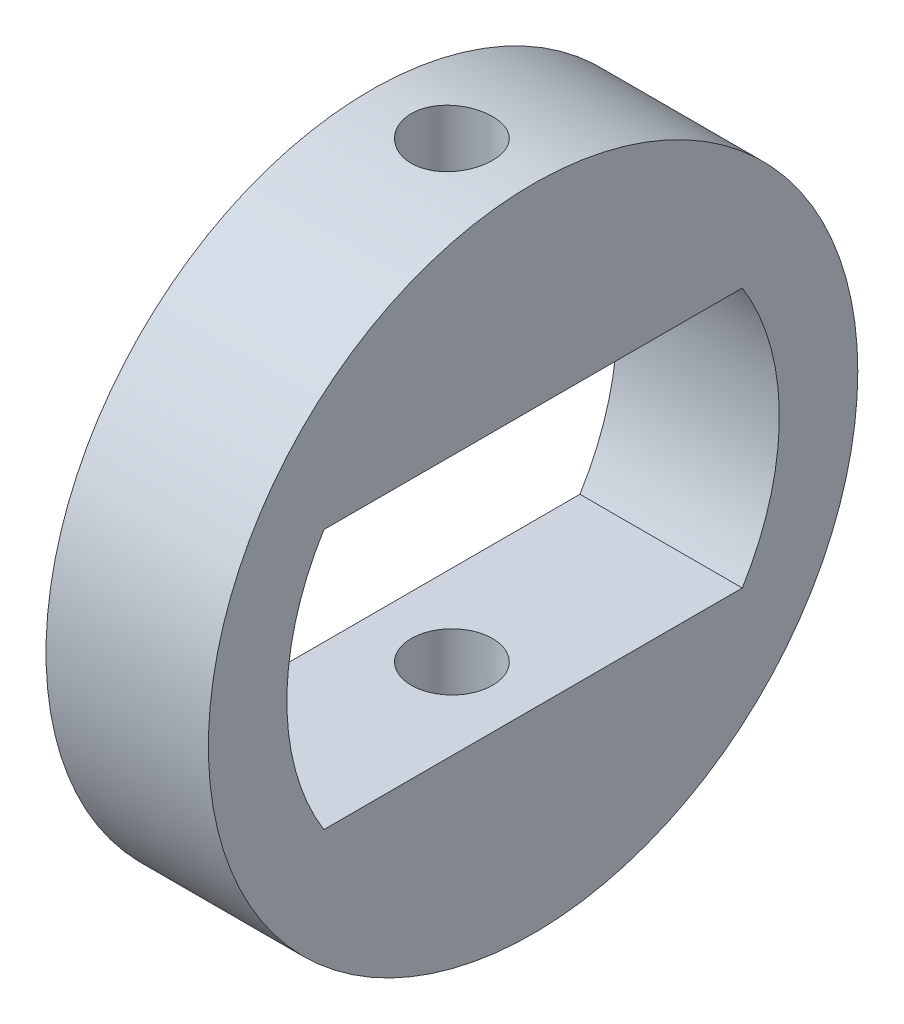
ISO-10303-21;
HEADER;
FILE_DESCRIPTION(('STEP AP214'),'2;1');
FILE_NAME('part.step','',(''),(''),'','','');
FILE_SCHEMA(('AUTOMOTIVE_DESIGN { 1 0 10303 214 1 1 1 1 }'));
ENDSEC;
DATA;
#1=APPLICATION_CONTEXT('core data for automotive mechanical design processes');
#2=APPLICATION_PROTOCOL_DEFINITION('international standard','automotive_design',2000,#1);
#3=PRODUCT_CONTEXT('',#1,'mechanical');
#4=PRODUCT('Part','Part','',(#3));
#5=PRODUCT_RELATED_PRODUCT_CATEGORY('part','',(#4));
#6=PRODUCT_DEFINITION_FORMATION('','',#4);
#7=PRODUCT_DEFINITION_CONTEXT('part definition',#1,'design');
#8=PRODUCT_DEFINITION('design','',#6,#7);
#9=PRODUCT_DEFINITION_SHAPE('','',#8);
#10=(LENGTH_UNIT() NAMED_UNIT(*) SI_UNIT(.MILLI.,.METRE.));
#11=(NAMED_UNIT(*) PLANE_ANGLE_UNIT() SI_UNIT($,.RADIAN.));
#12=(NAMED_UNIT(*) SI_UNIT($,.STERADIAN.) SOLID_ANGLE_UNIT());
#13=UNCERTAINTY_MEASURE_WITH_UNIT(LENGTH_MEASURE(1.E-05),#10,'distance_accuracy_value','');
#14=(GEOMETRIC_REPRESENTATION_CONTEXT(3) GLOBAL_UNCERTAINTY_ASSIGNED_CONTEXT((#13)) GLOBAL_UNIT_ASSIGNED_CONTEXT((#10,
#11,#12)) REPRESENTATION_CONTEXT('',''));
#15=CARTESIAN_POINT('',(0.,0.,0.));
#16=DIRECTION('',(0.,0.,1.));
#17=DIRECTION('',(1.,0.,0.));
#18=AXIS2_PLACEMENT_3D('',#15,#16,#17);
#19=CARTESIAN_POINT('',(3.,0.,0.));
#20=DIRECTION('',(1.,0.,0.));
#21=DIRECTION('',(0.,0.,-1.));
#22=AXIS2_PLACEMENT_3D('',#19,#20,#21);
#23=PLANE('',#22);
#24=CARTESIAN_POINT('',(3.,0.,0.));
#25=DIRECTION('',(1.,0.,0.));
#26=DIRECTION('',(0.,0.,-1.));
#27=AXIS2_PLACEMENT_3D('',#24,#25,#26);
#28=CIRCLE('',#27,6.);
#29=CARTESIAN_POINT('',(3.,0.,-6.));
#30=VERTEX_POINT('',#29);
#31=EDGE_CURVE('E11',#30,#30,#28,.T.);
#32=ORIENTED_EDGE('',*,*,#31,.T.);
#33=EDGE_LOOP('',(#32));
#34=FACE_BOUND('',#33,.T.);
#35=DIRECTION('',(0.,0.,-1.));
#36=VECTOR('',#35,1.);
#37=CARTESIAN_POINT('',(3.,-2.4,3.86555300054209));
#38=LINE('',#37,#36);
#39=CARTESIAN_POINT('',(3.,-2.4,3.86555300054209));
#40=VERTEX_POINT('',#39);
#41=CARTESIAN_POINT('',(3.,-2.4,-3.8655530005421));
#42=VERTEX_POINT('',#41);
#43=EDGE_CURVE('E85',#40,#42,#38,.T.);
#44=ORIENTED_EDGE('',*,*,#43,.F.);
#45=CARTESIAN_POINT('',(3.,0.,0.));
#46=DIRECTION('',(1.,0.,0.));
#47=DIRECTION('',(0.,0.,-1.));
#48=AXIS2_PLACEMENT_3D('',#45,#46,#47);
#49=CIRCLE('',#48,4.54999999999999);
#50=CARTESIAN_POINT('',(3.,2.4,3.86555300054209));
#51=VERTEX_POINT('',#50);
#52=EDGE_CURVE('E77',#51,#40,#49,.T.);
#53=ORIENTED_EDGE('',*,*,#52,.F.);
#54=DIRECTION('',(0.,0.,1.));
#55=VECTOR('',#54,1.);
#56=CARTESIAN_POINT('',(3.,2.4,3.86555300054209));
#57=LINE('',#56,#55);
#58=CARTESIAN_POINT('',(3.,2.4,-3.86555300054209));
#59=VERTEX_POINT('',#58);
#60=EDGE_CURVE('E98',#59,#51,#57,.T.);
#61=ORIENTED_EDGE('',*,*,#60,.F.);
#62=CARTESIAN_POINT('',(3.,0.,0.));
#63=DIRECTION('',(1.,0.,0.));
#64=DIRECTION('',(0.,0.,1.));
#65=AXIS2_PLACEMENT_3D('',#62,#63,#64);
#66=CIRCLE('',#65,4.55000000000001);
#67=EDGE_CURVE('E96',#42,#59,#66,.T.);
#68=ORIENTED_EDGE('',*,*,#67,.F.);
#69=EDGE_LOOP('',(#44,#53,#61,#68));
#70=FACE_BOUND('',#69,.T.);
#71=ADVANCED_FACE('F33',(#34,#70),#23,.T.);
#72=CARTESIAN_POINT('',(0.,0.,0.));
#73=DIRECTION('',(1.,0.,0.));
#74=DIRECTION('',(0.,0.,-1.));
#75=AXIS2_PLACEMENT_3D('',#72,#73,#74);
#76=PLANE('',#75);
#77=CARTESIAN_POINT('',(0.,0.,0.));
#78=DIRECTION('',(1.,0.,0.));
#79=DIRECTION('',(0.,0.,-1.));
#80=AXIS2_PLACEMENT_3D('',#77,#78,#79);
#81=CIRCLE('',#80,6.);
#82=CARTESIAN_POINT('',(0.,0.,-6.));
#83=VERTEX_POINT('',#82);
#84=EDGE_CURVE('E43',#83,#83,#81,.T.);
#85=ORIENTED_EDGE('',*,*,#84,.F.);
#86=EDGE_LOOP('',(#85));
#87=FACE_BOUND('',#86,.T.);
#88=CARTESIAN_POINT('',(0.,0.,0.));
#89=DIRECTION('',(1.,0.,0.));
#90=DIRECTION('',(0.,0.,-1.));
#91=AXIS2_PLACEMENT_3D('',#88,#89,#90);
#92=CIRCLE('',#91,4.54999999999999);
#93=CARTESIAN_POINT('',(0.,2.4,3.86555300054209));
#94=VERTEX_POINT('',#93);
#95=CARTESIAN_POINT('',(0.,-2.4,3.86555300054209));
#96=VERTEX_POINT('',#95);
#97=EDGE_CURVE('E59',#94,#96,#92,.T.);
#98=ORIENTED_EDGE('',*,*,#97,.T.);
#99=DIRECTION('',(0.,0.,-1.));
#100=VECTOR('',#99,1.);
#101=CARTESIAN_POINT('',(0.,-2.4,3.86555300054209));
#102=LINE('',#101,#100);
#103=CARTESIAN_POINT('',(0.,-2.4,-3.8655530005421));
#104=VERTEX_POINT('',#103);
#105=EDGE_CURVE('E92',#96,#104,#102,.T.);
#106=ORIENTED_EDGE('',*,*,#105,.T.);
#107=CARTESIAN_POINT('',(0.,0.,0.));
#108=DIRECTION('',(1.,0.,0.));
#109=DIRECTION('',(0.,0.,1.));
#110=AXIS2_PLACEMENT_3D('',#107,#108,#109);
#111=CIRCLE('',#110,4.55000000000001);
#112=CARTESIAN_POINT('',(0.,2.4,-3.86555300054209));
#113=VERTEX_POINT('',#112);
#114=EDGE_CURVE('E106',#104,#113,#111,.T.);
#115=ORIENTED_EDGE('',*,*,#114,.T.);
#116=DIRECTION('',(0.,0.,1.));
#117=VECTOR('',#116,1.);
#118=CARTESIAN_POINT('',(0.,2.4,3.86555300054209));
#119=LINE('',#118,#117);
#120=EDGE_CURVE('E86',#113,#94,#119,.T.);
#121=ORIENTED_EDGE('',*,*,#120,.T.);
#122=EDGE_LOOP('',(#98,#106,#115,#121));
#123=FACE_BOUND('',#122,.T.);
#124=ADVANCED_FACE('F117',(#87,#123),#76,.F.);
#125=CARTESIAN_POINT('',(3.,0.,0.));
#126=DIRECTION('',(-1.,0.,0.));
#127=DIRECTION('',(0.,0.,1.));
#128=AXIS2_PLACEMENT_3D('',#125,#126,#127);
#129=CYLINDRICAL_SURFACE('',#128,6.);
#130=CARTESIAN_POINT('',(0.75,-6.,0.));
#131=CARTESIAN_POINT('',(0.750001782280715,-5.99999941468929,0.0419523286667284));
#132=CARTESIAN_POINT('',(0.753531863750785,-5.99955535366471,0.0839308722908242));
#133=CARTESIAN_POINT('',(0.767558326371238,-5.99782662033408,0.166719840626926));
#134=CARTESIAN_POINT('',(0.778061981377016,-5.99654107032429,0.207528999187124));
#135=CARTESIAN_POINT('',(0.805721293174225,-5.99327418313322,0.286768672443916));
#136=CARTESIAN_POINT('',(0.822872472542956,-5.99129331436663,0.325200768043842));
#137=CARTESIAN_POINT('',(0.863330185190937,-5.98685610263429,0.398633842467911));
#138=CARTESIAN_POINT('',(0.886635662559214,-5.98439984125235,0.433635408466912));
#139=CARTESIAN_POINT('',(0.938877584951876,-5.97927096391898,0.499413845079396));
#140=CARTESIAN_POINT('',(0.967841138803871,-5.97659734407725,0.530169109481138));
#141=CARTESIAN_POINT('',(1.03051884706099,-5.97134317802925,0.586395838067249));
#142=CARTESIAN_POINT('',(1.06423324347397,-5.96876263657281,0.611867032917676));
#143=CARTESIAN_POINT('',(1.1355959932697,-5.96397691685876,0.656883048385183));
#144=CARTESIAN_POINT('',(1.17325720847038,-5.96177303153373,0.676407628782322));
#145=CARTESIAN_POINT('',(1.25135611558421,-5.95800338537305,0.708846922972536));
#146=CARTESIAN_POINT('',(1.2917937021441,-5.95643760033941,0.721761887419566));
#147=CARTESIAN_POINT('',(1.37407325867603,-5.95413101881084,0.74054969400743));
#148=CARTESIAN_POINT('',(1.41590677731126,-5.95338595031023,0.746459014419511));
#149=CARTESIAN_POINT('',(1.49997787904155,-5.95279208442838,0.75118066486717));
#150=CARTESIAN_POINT('',(1.54221544581939,-5.95294325100453,0.749993280300726));
#151=CARTESIAN_POINT('',(1.62564144817463,-5.95412086610926,0.740585170934372));
#152=CARTESIAN_POINT('',(1.66683449586008,-5.95514231388099,0.73240462889541));
#153=CARTESIAN_POINT('',(1.7472585063657,-5.95793759927289,0.709305114954617));
#154=CARTESIAN_POINT('',(1.78648942941421,-5.95971145213717,0.694386006525572));
#155=CARTESIAN_POINT('',(1.86200039970651,-5.96381734759395,0.658189667973497));
#156=CARTESIAN_POINT('',(1.89827199007469,-5.96615091963433,0.636894976112293));
#157=CARTESIAN_POINT('',(1.96674200832397,-5.97111213429179,0.588564440837077));
#158=CARTESIAN_POINT('',(1.9989402497921,-5.97373979035699,0.561528334824235));
#159=CARTESIAN_POINT('',(2.05858281321682,-5.97901532967128,0.502259733226135));
#160=CARTESIAN_POINT('',(2.08599272752979,-5.98166322716067,0.469992602352005));
#161=CARTESIAN_POINT('',(2.13501266400916,-5.98666389766756,0.401297150734179));
#162=CARTESIAN_POINT('',(2.1566226728016,-5.98901667000452,0.364868820395477));
#163=CARTESIAN_POINT('',(2.19342939613917,-5.99316345665574,0.288858501409046));
#164=CARTESIAN_POINT('',(2.20862395616437,-5.99495728320461,0.249275458601317));
#165=CARTESIAN_POINT('',(2.23214114805698,-5.99778235734018,0.168092382129319));
#166=CARTESIAN_POINT('',(2.24046410164111,-5.99881364062761,0.126492442989202));
#167=CARTESIAN_POINT('',(2.24995722727817,-5.99999278923228,0.0427539491740509));
#168=CARTESIAN_POINT('',(2.25117479770922,-6.00014650842791,0.000620847059583924));
#169=CARTESIAN_POINT('',(2.24654767978322,-5.99956901401629,-0.0832488109492471));
#170=CARTESIAN_POINT('',(2.24070314182452,-5.99883781925464,-0.12498537526941));
#171=CARTESIAN_POINT('',(2.22215708736769,-5.99657630627008,-0.206737352316455));
#172=CARTESIAN_POINT('',(2.20947817097921,-5.99504862244161,-0.24675797112741));
#173=CARTESIAN_POINT('',(2.17764676442613,-5.99136516930059,-0.324104896457521));
#174=CARTESIAN_POINT('',(2.15849405445257,-5.98920937866187,-0.361431111439593));
#175=CARTESIAN_POINT('',(2.11414405874776,-5.98449546873034,-0.432541356206227));
#176=CARTESIAN_POINT('',(2.08891611305831,-5.98193533212753,-0.466306127983144));
#177=CARTESIAN_POINT('',(2.03317515073974,-5.97670542697697,-0.529139096887894));
#178=CARTESIAN_POINT('',(2.0026619243247,-5.9740356540807,-0.558207107501056));
#179=CARTESIAN_POINT('',(1.93700777497286,-5.96886931638775,-0.610989587645404));
#180=CARTESIAN_POINT('',(1.90184149610688,-5.96637382416398,-0.634672638170379));
#181=CARTESIAN_POINT('',(1.82800252654359,-5.96185623311145,-0.675795866833051));
#182=CARTESIAN_POINT('',(1.78932990615705,-5.95983412479308,-0.69323617011851));
#183=CARTESIAN_POINT('',(1.70967740425572,-5.95649955117899,-0.721327973659961));
#184=CARTESIAN_POINT('',(1.66870385098561,-5.95518523555437,-0.731997188237132));
#185=CARTESIAN_POINT('',(1.5855292548658,-5.95340974772236,-0.746300998160353));
#186=CARTESIAN_POINT('',(1.5433282692123,-5.95294853582633,-0.749935920760728));
#187=CARTESIAN_POINT('',(1.4592093212386,-5.95293263094737,-0.75006196082545));
#188=CARTESIAN_POINT('',(1.41729142550043,-5.95337167425586,-0.746602439309782));
#189=CARTESIAN_POINT('',(1.33463786119648,-5.9550933436116,-0.732742321454797));
#190=CARTESIAN_POINT('',(1.29390219275736,-5.95637596974924,-0.72234172437173));
#191=CARTESIAN_POINT('',(1.21477591297008,-5.95963834732365,-0.694910122106897));
#192=CARTESIAN_POINT('',(1.17638446649346,-5.96161784877835,-0.67788149429128));
#193=CARTESIAN_POINT('',(1.10299600378551,-5.96605134973446,-0.637682070645093));
#194=CARTESIAN_POINT('',(1.06799903009405,-5.96850535518124,-0.614511197852877));
#195=CARTESIAN_POINT('',(1.00214063239786,-5.9736318142567,-0.562501899379751));
#196=CARTESIAN_POINT('',(0.971308361713507,-5.9763056162521,-0.533626687732487));
#197=CARTESIAN_POINT('',(0.914907952449609,-5.9815584947787,-0.471105068090515));
#198=CARTESIAN_POINT('',(0.889341056767707,-5.98413754882677,-0.43745753674247));
#199=CARTESIAN_POINT('',(0.844114392868412,-5.98892116976024,-0.366199686256263));
#200=CARTESIAN_POINT('',(0.824477458230224,-5.9911242752349,-0.328574783878851));
#201=CARTESIAN_POINT('',(0.791828627125116,-5.99489294723018,-0.250554870690384));
#202=CARTESIAN_POINT('',(0.778809532093962,-5.99645920610873,-0.210162924261071));
#203=CARTESIAN_POINT('',(0.762882198548608,-5.99840016098324,-0.141301731590377));
#204=CARTESIAN_POINT('',(0.758058317405381,-5.99899717768636,-0.113266699055076));
#205=CARTESIAN_POINT('',(0.751616626292033,-5.99979729398757,-0.0568251189637304));
#206=CARTESIAN_POINT('',(0.749998792680209,-6.00000039649041,-0.0284185741488082));
#207=CARTESIAN_POINT('',(0.75,-6.,0.));
#208=B_SPLINE_CURVE_WITH_KNOTS('',3,(#130,#131,#132,#133,#134,#135,#136,#137,#138,#139,#140,
#141,#142,#143,#144,#145,#146,#147,#148,#149,#150,#151,#152,#153,#154,#155,#156,#157,#158,#159,
#160,#161,#162,#163,#164,#165,#166,#167,#168,#169,#170,#171,#172,#173,#174,#175,#176,#177,#178,
#179,#180,#181,#182,#183,#184,#185,#186,#187,#188,#189,#190,#191,#192,#193,#194,#195,#196,#197,
#198,#199,#200,#201,#202,#203,#204,#205,#206,#207),.UNSPECIFIED.,.T.,.F.,(4,2,2,2,2,2,2,2,2,2,2,
2,2,2,2,2,2,2,2,2,2,2,2,2,2,2,2,2,2,2,2,2,2,2,2,2,2,2,4),(0.,0.125753181832874,
0.251637738283028,0.377437652454531,0.50321599677322,0.629612439605529,0.756015323400033,
0.882843750956609,1.00966736849042,1.13582767585896,1.26198290965399,1.38741808932508,
1.51285581049872,1.6386402788566,1.76443050154092,1.89109043440925,2.01775065933934,
2.14445338719482,2.27115018271134,2.39700083817576,2.52284881350579,2.64828316168019,
2.77372176923684,2.89980720878527,3.02589765412527,3.15270591452272,3.27951163266462,
3.40598422284278,3.53245092903187,3.65804070360665,3.78363049163865,3.90917527411946,
4.03472162973679,4.16110571307549,4.28751959541004,4.41441420911056,4.5411704960521,
4.62635652956289,4.71154193490131),.UNSPECIFIED.);
#209=CARTESIAN_POINT('',(0.75,-6.,0.));
#210=VERTEX_POINT('',#209);
#211=EDGE_CURVE('E104',#210,#210,#208,.T.);
#212=ORIENTED_EDGE('',*,*,#211,.T.);
#213=EDGE_LOOP('',(#212));
#214=FACE_BOUND('',#213,.T.);
#215=CARTESIAN_POINT('',(1.5,5.95294044989533,0.750000000000001));
#216=CARTESIAN_POINT('',(1.45804911486245,5.95294105251399,0.749998216450186));
#217=CARTESIAN_POINT('',(1.41607201052856,5.95338868535683,0.746468369706387));
#218=CARTESIAN_POINT('',(1.33328603237862,5.95513017293991,0.732442924116403));
#219=CARTESIAN_POINT('',(1.29247842585089,5.95642491192888,0.721940046327389));
#220=CARTESIAN_POINT('',(1.21324203536519,5.95971172132628,0.694283007847789));
#221=CARTESIAN_POINT('',(1.1748116573644,5.96170331836095,0.677133361439473));
#222=CARTESIAN_POINT('',(1.10138146445308,5.96615887055972,0.63667925952886));
#223=CARTESIAN_POINT('',(1.06638106447708,5.96862274495285,0.613375856212438));
#224=CARTESIAN_POINT('',(1.00060132586336,5.9737606777317,0.561136035079327));
#225=CARTESIAN_POINT('',(0.969843959304334,5.97643572510613,0.53217204450729));
#226=CARTESIAN_POINT('',(0.913613169318278,5.9816856986275,0.46949257820137));
#227=CARTESIAN_POINT('',(0.888140008771593,5.98426061978815,0.435776866217411));
#228=CARTESIAN_POINT('',(0.84312192614809,5.98903033383847,0.364412949202793));
#229=CARTESIAN_POINT('',(0.823596886470102,5.99122384154042,0.326752108668335));
#230=CARTESIAN_POINT('',(0.79115664001771,5.99497271086358,0.248654015416776));
#231=CARTESIAN_POINT('',(0.778241187922045,5.9965280961689,0.208216865808273));
#232=CARTESIAN_POINT('',(0.759452379499672,5.99881850611869,0.125938706325335));
#233=CARTESIAN_POINT('',(0.753542496442832,5.99955778450782,0.0841061578990143));
#234=CARTESIAN_POINT('',(0.748819384489038,6.00014720918765,3.69602059648605E-05));
#235=CARTESIAN_POINT('',(0.750005876414237,5.99999739045624,-0.0421996730984305));
#236=CARTESIAN_POINT('',(0.759412560827228,5.99882894331003,-0.125629580692364));
#237=CARTESIAN_POINT('',(0.767593469544412,5.99781516736718,-0.166827361729335));
#238=CARTESIAN_POINT('',(0.79069535298898,5.995038167827,-0.247260649171612));
#239=CARTESIAN_POINT('',(0.805616455850049,5.99327492998214,-0.286496118256861));
#240=CARTESIAN_POINT('',(0.841816947835135,5.98918877342374,-0.362012644631591));
#241=CARTESIAN_POINT('',(0.863113337319054,5.98686436152972,-0.398285468352155));
#242=CARTESIAN_POINT('',(0.911447508664808,5.98191590719585,-0.466757235691943));
#243=CARTESIAN_POINT('',(0.938485553840572,5.97929185101679,-0.498955992365207));
#244=CARTESIAN_POINT('',(0.997755545579514,5.97401660257054,-0.558596409231883));
#245=CARTESIAN_POINT('',(1.030021727864,5.97136534741418,-0.586004051998798));
#246=CARTESIAN_POINT('',(1.09871446703474,5.96635221582174,-0.635019855187531));
#247=CARTESIAN_POINT('',(1.13514103696142,5.96399034029274,-0.656627997430528));
#248=CARTESIAN_POINT('',(1.2111508486687,5.95982340783815,-0.69343337207482));
#249=CARTESIAN_POINT('',(1.25073542398596,5.95801858772439,-0.708627878958698));
#250=CARTESIAN_POINT('',(1.33192183605805,5.95517472748787,-0.732144496340426));
#251=CARTESIAN_POINT('',(1.37352357549262,5.95413565046011,-0.740466938039886));
#252=CARTESIAN_POINT('',(1.45726295459993,5.95294766635215,-0.749958129572582));
#253=CARTESIAN_POINT('',(1.49939508692664,5.95279280232713,-0.751174752599485));
#254=CARTESIAN_POINT('',(1.58326257889962,5.95337502335894,-0.746546085969167));
#255=CARTESIAN_POINT('',(1.62499794698379,5.95411208940435,-0.740700946832942));
#256=CARTESIAN_POINT('',(1.70674372907336,5.95638968545196,-0.722154985739318));
#257=CARTESIAN_POINT('',(1.74675948455712,5.95792749808398,-0.709477345123817));
#258=CARTESIAN_POINT('',(1.82409724645595,5.96163110991242,-0.677650115734838));
#259=CARTESIAN_POINT('',(1.86141915817226,5.96379693117229,-0.658500299574367));
#260=CARTESIAN_POINT('',(1.9325263931439,5.9685267940597,-0.614154606646476));
#261=CARTESIAN_POINT('',(1.96629199959433,5.97109287821125,-0.588927335873131));
#262=CARTESIAN_POINT('',(2.02912696618051,5.97632771865307,-0.533187222710686));
#263=CARTESIAN_POINT('',(2.0581961435604,5.97899647893387,-0.502674174727644));
#264=CARTESIAN_POINT('',(2.11098125620032,5.98415426606088,-0.437019532667556));
#265=CARTESIAN_POINT('',(2.1346657340385,5.98664218173757,-0.401852547635109));
#266=CARTESIAN_POINT('',(2.17579146529014,5.99114133909483,-0.328011774504536));
#267=CARTESIAN_POINT('',(2.19323284454429,5.99315259038315,-0.289338057110496));
#268=CARTESIAN_POINT('',(2.22132533607241,5.99646687195956,-0.209686157741836));
#269=CARTESIAN_POINT('',(2.23199462880948,5.99777179706312,-0.168714469953533));
#270=CARTESIAN_POINT('',(2.24629922676803,5.99953426403269,-0.0855438171833875));
#271=CARTESIAN_POINT('',(2.24993484917977,5.99999184411053,-0.0433449076314315));
#272=CARTESIAN_POINT('',(2.25006297668765,6.000007884041,0.040775155003136));
#273=CARTESIAN_POINT('',(2.24660398817039,5.99957244950352,0.0826962413144212));
#274=CARTESIAN_POINT('',(2.23274381597075,5.99786352347382,0.165356322435785));
#275=CARTESIAN_POINT('',(2.22234263711647,5.99659003256444,0.206095318067956));
#276=CARTESIAN_POINT('',(2.19490856569509,5.9933474556361,0.285228432896196));
#277=CARTESIAN_POINT('',(2.17787799618803,5.99137861330341,0.323623368047872));
#278=CARTESIAN_POINT('',(2.13767360561773,5.98696334281884,0.397018001143208));
#279=CARTESIAN_POINT('',(2.11449971152149,5.98451690898936,0.43201765871641));
#280=CARTESIAN_POINT('',(2.06248703539909,5.97939958177674,0.497876030388768));
#281=CARTESIAN_POINT('',(2.03361216194291,5.97672732383676,0.528706136350291));
#282=CARTESIAN_POINT('',(1.97109211679134,5.97147047704062,0.585102335645804));
#283=CARTESIAN_POINT('',(1.93744581675273,5.96888590910099,0.610667180338048));
#284=CARTESIAN_POINT('',(1.86618902319079,5.96408643418406,0.655891572754812));
#285=CARTESIAN_POINT('',(1.82856372301947,5.96187299325685,0.675527934950022));
#286=CARTESIAN_POINT('',(1.75054297782157,5.95808357435887,0.708175586503007));
#287=CARTESIAN_POINT('',(1.71015060020898,5.95650690346163,0.721194081368495));
#288=CARTESIAN_POINT('',(1.64129100388694,5.95455236045953,0.737119768871394));
#289=CARTESIAN_POINT('',(1.61325811453873,5.95395090456573,0.741942909303175));
#290=CARTESIAN_POINT('',(1.55682082500992,5.95314474668974,0.748383616771654));
#291=CARTESIAN_POINT('',(1.52841642764971,5.95294004169728,0.750001208129797));
#292=CARTESIAN_POINT('',(1.5,5.95294044989533,0.750000000000001));
#293=B_SPLINE_CURVE_WITH_KNOTS('',3,(#215,#216,#217,#218,#219,#220,#221,#222,#223,#224,#225,
#226,#227,#228,#229,#230,#231,#232,#233,#234,#235,#236,#237,#238,#239,#240,#241,#242,#243,#244,
#245,#246,#247,#248,#249,#250,#251,#252,#253,#254,#255,#256,#257,#258,#259,#260,#261,#262,#263,
#264,#265,#266,#267,#268,#269,#270,#271,#272,#273,#274,#275,#276,#277,#278,#279,#280,#281,#282,
#283,#284,#285,#286,#287,#288,#289,#290,#291,#292),.UNSPECIFIED.,.T.,.F.,(4,2,2,2,2,2,2,2,2,2,2,
2,2,2,2,2,2,2,2,2,2,2,2,2,2,2,2,2,2,2,2,2,2,2,2,2,2,2,4),(0.,0.125748845243772,
0.251629162845715,0.377424135774361,0.503197613851839,0.629599732647198,0.756008138227737,
0.882834558437223,1.00965627101949,1.13581379082437,1.26196634751033,1.38741499479912,
1.51286602701537,1.63865461323841,1.76444896940732,1.89110309213331,2.01775761185828,
2.14446590021703,2.27116808146857,2.39701565341765,2.52286054298135,2.6482811288782,
2.77370612163556,2.89979345863234,3.02588570098443,3.15269665767703,3.27950505812664,
3.40597157035482,3.53243237931844,3.65803144886477,3.78363043106037,3.90918544063227,
4.03474194289275,4.16112038667251,4.28752876631949,4.41442529311451,4.54118335794605,
4.62636296889885,4.71154193356643),.UNSPECIFIED.);
#294=CARTESIAN_POINT('',(1.5,5.95294044989533,0.750000000000001));
#295=VERTEX_POINT('',#294);
#296=EDGE_CURVE('E153',#295,#295,#293,.T.);
#297=ORIENTED_EDGE('',*,*,#296,.T.);
#298=EDGE_LOOP('',(#297));
#299=FACE_BOUND('',#298,.T.);
#300=ORIENTED_EDGE('',*,*,#31,.F.);
#301=EDGE_LOOP('',(#300));
#302=FACE_BOUND('',#301,.T.);
#303=ORIENTED_EDGE('',*,*,#84,.T.);
#304=EDGE_LOOP('',(#303));
#305=FACE_BOUND('',#304,.T.);
#306=ADVANCED_FACE('F35',(#214,#299,#302,#305),#129,.T.);
#307=CARTESIAN_POINT('',(3.,0.,0.));
#308=DIRECTION('',(-1.,0.,0.));
#309=DIRECTION('',(0.,0.,1.));
#310=AXIS2_PLACEMENT_3D('',#307,#308,#309);
#311=CYLINDRICAL_SURFACE('',#310,4.54999999999999);
#312=ORIENTED_EDGE('',*,*,#97,.F.);
#313=DIRECTION('',(-1.,0.,0.));
#314=VECTOR('',#313,1.);
#315=CARTESIAN_POINT('',(3.,2.4,3.86555300054209));
#316=LINE('',#315,#314);
#317=EDGE_CURVE('E81',#51,#94,#316,.T.);
#318=ORIENTED_EDGE('',*,*,#317,.F.);
#319=ORIENTED_EDGE('',*,*,#52,.T.);
#320=DIRECTION('',(-1.,0.,0.));
#321=VECTOR('',#320,1.);
#322=CARTESIAN_POINT('',(3.,-2.4,3.86555300054209));
#323=LINE('',#322,#321);
#324=EDGE_CURVE('E80',#40,#96,#323,.T.);
#325=ORIENTED_EDGE('',*,*,#324,.T.);
#326=EDGE_LOOP('',(#312,#318,#319,#325));
#327=FACE_BOUND('',#326,.T.);
#328=ADVANCED_FACE('F79',(#327),#311,.F.);
#329=CARTESIAN_POINT('',(3.,-2.4,3.86555300054209));
#330=DIRECTION('',(0.,1.,0.));
#331=DIRECTION('',(0.,0.,1.));
#332=AXIS2_PLACEMENT_3D('',#329,#330,#331);
#333=PLANE('',#332);
#334=CARTESIAN_POINT('',(1.5,-2.4,0.));
#335=DIRECTION('',(0.,1.,0.));
#336=DIRECTION('',(0.,0.,1.));
#337=AXIS2_PLACEMENT_3D('',#334,#335,#336);
#338=CIRCLE('',#337,0.75);
#339=CARTESIAN_POINT('',(1.5,-2.4,0.750000000000001));
#340=VERTEX_POINT('',#339);
#341=EDGE_CURVE('E151',#340,#340,#338,.T.);
#342=ORIENTED_EDGE('',*,*,#341,.F.);
#343=EDGE_LOOP('',(#342));
#344=FACE_BOUND('',#343,.T.);
#345=ORIENTED_EDGE('',*,*,#105,.F.);
#346=ORIENTED_EDGE('',*,*,#324,.F.);
#347=ORIENTED_EDGE('',*,*,#43,.T.);
#348=DIRECTION('',(-1.,0.,0.));
#349=VECTOR('',#348,1.);
#350=CARTESIAN_POINT('',(3.,-2.4,-3.8655530005421));
#351=LINE('',#350,#349);
#352=EDGE_CURVE('E93',#42,#104,#351,.T.);
#353=ORIENTED_EDGE('',*,*,#352,.T.);
#354=EDGE_LOOP('',(#345,#346,#347,#353));
#355=FACE_BOUND('',#354,.T.);
#356=ADVANCED_FACE('F89',(#344,#355),#333,.T.);
#357=CARTESIAN_POINT('',(3.,0.,0.));
#358=DIRECTION('',(-1.,0.,0.));
#359=DIRECTION('',(0.,0.,1.));
#360=AXIS2_PLACEMENT_3D('',#357,#358,#359);
#361=CYLINDRICAL_SURFACE('',#360,4.55000000000001);
#362=ORIENTED_EDGE('',*,*,#114,.F.);
#363=ORIENTED_EDGE('',*,*,#352,.F.);
#364=ORIENTED_EDGE('',*,*,#67,.T.);
#365=DIRECTION('',(-1.,0.,0.));
#366=VECTOR('',#365,1.);
#367=CARTESIAN_POINT('',(3.,2.4,-3.86555300054209));
#368=LINE('',#367,#366);
#369=EDGE_CURVE('E51',#59,#113,#368,.T.);
#370=ORIENTED_EDGE('',*,*,#369,.T.);
#371=EDGE_LOOP('',(#362,#363,#364,#370));
#372=FACE_BOUND('',#371,.T.);
#373=ADVANCED_FACE('F124',(#372),#361,.F.);
#374=CARTESIAN_POINT('',(3.,2.4,3.86555300054209));
#375=DIRECTION('',(0.,-1.,0.));
#376=DIRECTION('',(0.,0.,-1.));
#377=AXIS2_PLACEMENT_3D('',#374,#375,#376);
#378=PLANE('',#377);
#379=CARTESIAN_POINT('',(1.5,2.4,0.));
#380=DIRECTION('',(0.,-1.,0.));
#381=DIRECTION('',(0.,0.,-1.));
#382=AXIS2_PLACEMENT_3D('',#379,#380,#381);
#383=CIRCLE('',#382,0.75);
#384=CARTESIAN_POINT('',(1.5,2.4,-0.749999999999999));
#385=VERTEX_POINT('',#384);
#386=EDGE_CURVE('E38',#385,#385,#383,.T.);
#387=ORIENTED_EDGE('',*,*,#386,.F.);
#388=EDGE_LOOP('',(#387));
#389=FACE_BOUND('',#388,.T.);
#390=ORIENTED_EDGE('',*,*,#120,.F.);
#391=ORIENTED_EDGE('',*,*,#369,.F.);
#392=ORIENTED_EDGE('',*,*,#60,.T.);
#393=ORIENTED_EDGE('',*,*,#317,.T.);
#394=EDGE_LOOP('',(#390,#391,#392,#393));
#395=FACE_BOUND('',#394,.T.);
#396=ADVANCED_FACE('F121',(#389,#395),#378,.T.);
#397=CARTESIAN_POINT('',(1.5,-6.,0.));
#398=DIRECTION('',(0.,1.,0.));
#399=DIRECTION('',(0.,0.,1.));
#400=AXIS2_PLACEMENT_3D('',#397,#398,#399);
#401=CYLINDRICAL_SURFACE('',#400,0.75);
#402=ORIENTED_EDGE('',*,*,#386,.T.);
#403=EDGE_LOOP('',(#402));
#404=FACE_BOUND('',#403,.T.);
#405=ORIENTED_EDGE('',*,*,#296,.F.);
#406=EDGE_LOOP('',(#405));
#407=FACE_BOUND('',#406,.T.);
#408=ADVANCED_FACE('F123',(#404,#407),#401,.F.);
#409=ORIENTED_EDGE('',*,*,#341,.T.);
#410=EDGE_LOOP('',(#409));
#411=FACE_BOUND('',#410,.T.);
#412=ORIENTED_EDGE('',*,*,#211,.F.);
#413=EDGE_LOOP('',(#412));
#414=FACE_BOUND('',#413,.T.);
#415=ADVANCED_FACE('F131',(#411,#414),#401,.F.);
#416=CLOSED_SHELL('',(#71,#124,#306,#328,#356,#373,#396,#408,#415));
#417=MANIFOLD_SOLID_BREP('B2',#416);
#418=ADVANCED_BREP_SHAPE_REPRESENTATION('',(#18,#417),#14);
#419=SHAPE_DEFINITION_REPRESENTATION(#9,#418);
ENDSEC;
END-ISO-10303-21;
